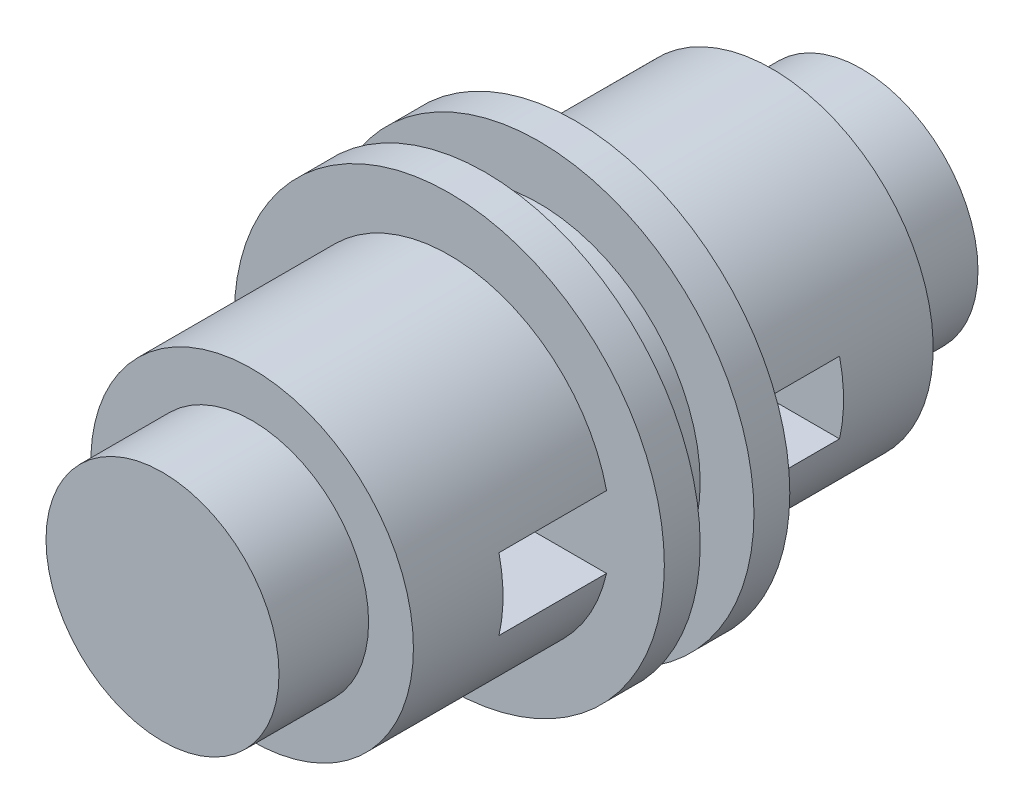
ISO-10303-21;
HEADER;
FILE_DESCRIPTION(('STEP AP214'),'2;1');
FILE_NAME('part.step','',(''),(''),'','','');
FILE_SCHEMA(('AUTOMOTIVE_DESIGN { 1 0 10303 214 1 1 1 1 }'));
ENDSEC;
DATA;
#1=APPLICATION_CONTEXT('core data for automotive mechanical design processes');
#2=APPLICATION_PROTOCOL_DEFINITION('international standard','automotive_design',2000,#1);
#3=PRODUCT_CONTEXT('',#1,'mechanical');
#4=PRODUCT('Part','Part','',(#3));
#5=PRODUCT_RELATED_PRODUCT_CATEGORY('part','',(#4));
#6=PRODUCT_DEFINITION_FORMATION('','',#4);
#7=PRODUCT_DEFINITION_CONTEXT('part definition',#1,'design');
#8=PRODUCT_DEFINITION('design','',#6,#7);
#9=PRODUCT_DEFINITION_SHAPE('','',#8);
#10=(LENGTH_UNIT() NAMED_UNIT(*) SI_UNIT(.MILLI.,.METRE.));
#11=(NAMED_UNIT(*) PLANE_ANGLE_UNIT() SI_UNIT($,.RADIAN.));
#12=(NAMED_UNIT(*) SI_UNIT($,.STERADIAN.) SOLID_ANGLE_UNIT());
#13=UNCERTAINTY_MEASURE_WITH_UNIT(LENGTH_MEASURE(1.E-05),#10,'distance_accuracy_value','');
#14=(GEOMETRIC_REPRESENTATION_CONTEXT(3) GLOBAL_UNCERTAINTY_ASSIGNED_CONTEXT((#13)) GLOBAL_UNIT_ASSIGNED_CONTEXT((#10,
#11,#12)) REPRESENTATION_CONTEXT('',''));
#15=CARTESIAN_POINT('',(0.,0.,0.));
#16=DIRECTION('',(0.,0.,1.));
#17=DIRECTION('',(1.,0.,0.));
#18=AXIS2_PLACEMENT_3D('',#15,#16,#17);
#19=CARTESIAN_POINT('',(0.,0.,3.));
#20=DIRECTION('',(0.,0.,-1.));
#21=DIRECTION('',(-1.,0.,0.));
#22=AXIS2_PLACEMENT_3D('',#19,#20,#21);
#23=CYLINDRICAL_SURFACE('',#22,4.5);
#24=CARTESIAN_POINT('',(0.,0.,0.));
#25=DIRECTION('',(0.,0.,1.));
#26=DIRECTION('',(1.,0.,0.));
#27=AXIS2_PLACEMENT_3D('',#24,#25,#26);
#28=CIRCLE('',#27,4.5);
#29=CARTESIAN_POINT('',(4.38748219369606,1.,0.));
#30=VERTEX_POINT('',#29);
#31=CARTESIAN_POINT('',(-4.38748219369606,1.,0.));
#32=VERTEX_POINT('',#31);
#33=EDGE_CURVE('E161',#30,#32,#28,.T.);
#34=ORIENTED_EDGE('',*,*,#33,.T.);
#35=DIRECTION('',(0.,0.,-1.));
#36=VECTOR('',#35,1.);
#37=CARTESIAN_POINT('',(-4.38748219369606,1.,3.));
#38=LINE('',#37,#36);
#39=CARTESIAN_POINT('',(-4.38748219369606,1.,3.));
#40=VERTEX_POINT('',#39);
#41=EDGE_CURVE('E195',#32,#40,#38,.F.);
#42=ORIENTED_EDGE('',*,*,#41,.T.);
#43=CARTESIAN_POINT('',(0.,0.,3.));
#44=DIRECTION('',(0.,0.,1.));
#45=DIRECTION('',(1.,0.,0.));
#46=AXIS2_PLACEMENT_3D('',#43,#44,#45);
#47=CIRCLE('',#46,4.5);
#48=CARTESIAN_POINT('',(-4.38748219369606,-1.,3.));
#49=VERTEX_POINT('',#48);
#50=EDGE_CURVE('E44',#40,#49,#47,.T.);
#51=ORIENTED_EDGE('',*,*,#50,.T.);
#52=DIRECTION('',(0.,0.,-1.));
#53=VECTOR('',#52,1.);
#54=CARTESIAN_POINT('',(-4.38748219369606,-1.,3.));
#55=LINE('',#54,#53);
#56=CARTESIAN_POINT('',(-4.38748219369606,-1.,0.));
#57=VERTEX_POINT('',#56);
#58=EDGE_CURVE('E178',#49,#57,#55,.T.);
#59=ORIENTED_EDGE('',*,*,#58,.T.);
#60=CARTESIAN_POINT('',(4.38748219369606,-1.,0.));
#61=VERTEX_POINT('',#60);
#62=EDGE_CURVE('E165',#57,#61,#28,.T.);
#63=ORIENTED_EDGE('',*,*,#62,.T.);
#64=DIRECTION('',(0.,0.,-1.));
#65=VECTOR('',#64,1.);
#66=CARTESIAN_POINT('',(4.38748219369606,-1.,3.));
#67=LINE('',#66,#65);
#68=CARTESIAN_POINT('',(4.38748219369606,-1.,3.));
#69=VERTEX_POINT('',#68);
#70=EDGE_CURVE('E176',#61,#69,#67,.F.);
#71=ORIENTED_EDGE('',*,*,#70,.T.);
#72=CARTESIAN_POINT('',(4.38748219369606,1.,3.));
#73=VERTEX_POINT('',#72);
#74=EDGE_CURVE('E11',#69,#73,#47,.T.);
#75=ORIENTED_EDGE('',*,*,#74,.T.);
#76=DIRECTION('',(0.,0.,-1.));
#77=VECTOR('',#76,1.);
#78=CARTESIAN_POINT('',(4.38748219369606,1.,3.));
#79=LINE('',#78,#77);
#80=EDGE_CURVE('E197',#73,#30,#79,.T.);
#81=ORIENTED_EDGE('',*,*,#80,.T.);
#82=EDGE_LOOP('',(#34,#42,#51,#59,#63,#71,#75,#81));
#83=FACE_BOUND('',#82,.T.);
#84=CARTESIAN_POINT('',(0.,0.,5.5));
#85=DIRECTION('',(0.,0.,1.));
#86=DIRECTION('',(1.,0.,0.));
#87=AXIS2_PLACEMENT_3D('',#84,#85,#86);
#88=CIRCLE('',#87,4.5);
#89=CARTESIAN_POINT('',(4.5,0.,5.5));
#90=VERTEX_POINT('',#89);
#91=EDGE_CURVE('E202',#90,#90,#88,.T.);
#92=ORIENTED_EDGE('',*,*,#91,.F.);
#93=EDGE_LOOP('',(#92));
#94=FACE_BOUND('',#93,.T.);
#95=ADVANCED_FACE('F41',(#83,#94),#23,.T.);
#96=CARTESIAN_POINT('',(0.,0.,-1.));
#97=DIRECTION('',(0.,0.,1.));
#98=DIRECTION('',(1.,0.,0.));
#99=AXIS2_PLACEMENT_3D('',#96,#97,#98);
#100=CYLINDRICAL_SURFACE('',#99,6.);
#101=CARTESIAN_POINT('',(0.,0.,-1.));
#102=DIRECTION('',(0.,0.,-1.));
#103=DIRECTION('',(-1.,0.,0.));
#104=AXIS2_PLACEMENT_3D('',#101,#102,#103);
#105=CIRCLE('',#104,6.);
#106=CARTESIAN_POINT('',(-6.,0.,-1.));
#107=VERTEX_POINT('',#106);
#108=EDGE_CURVE('E162',#107,#107,#105,.T.);
#109=ORIENTED_EDGE('',*,*,#108,.F.);
#110=EDGE_LOOP('',(#109));
#111=FACE_BOUND('',#110,.T.);
#112=CARTESIAN_POINT('',(0.,0.,0.));
#113=DIRECTION('',(0.,0.,-1.));
#114=DIRECTION('',(-1.,0.,0.));
#115=AXIS2_PLACEMENT_3D('',#112,#113,#114);
#116=CIRCLE('',#115,6.);
#117=CARTESIAN_POINT('',(-6.,0.,0.));
#118=VERTEX_POINT('',#117);
#119=EDGE_CURVE('E158',#118,#118,#116,.T.);
#120=ORIENTED_EDGE('',*,*,#119,.T.);
#121=EDGE_LOOP('',(#120));
#122=FACE_BOUND('',#121,.T.);
#123=ADVANCED_FACE('F230',(#111,#122),#100,.T.);
#124=CARTESIAN_POINT('',(0.,0.,-1.));
#125=DIRECTION('',(0.,0.,-1.));
#126=DIRECTION('',(-1.,0.,0.));
#127=AXIS2_PLACEMENT_3D('',#124,#125,#126);
#128=PLANE('',#127);
#129=CARTESIAN_POINT('',(0.,0.,-1.));
#130=DIRECTION('',(0.,0.,-1.));
#131=DIRECTION('',(-1.,0.,0.));
#132=AXIS2_PLACEMENT_3D('',#129,#130,#131);
#133=CIRCLE('',#132,4.5);
#134=CARTESIAN_POINT('',(-4.5,0.,-1.));
#135=VERTEX_POINT('',#134);
#136=EDGE_CURVE('E148',#135,#135,#133,.T.);
#137=ORIENTED_EDGE('',*,*,#136,.F.);
#138=EDGE_LOOP('',(#137));
#139=FACE_BOUND('',#138,.T.);
#140=ORIENTED_EDGE('',*,*,#108,.T.);
#141=EDGE_LOOP('',(#140));
#142=FACE_BOUND('',#141,.T.);
#143=ADVANCED_FACE('F235',(#139,#142),#128,.T.);
#144=CARTESIAN_POINT('',(0.,0.,0.));
#145=DIRECTION('',(0.,0.,-1.));
#146=DIRECTION('',(-1.,0.,0.));
#147=AXIS2_PLACEMENT_3D('',#144,#145,#146);
#148=PLANE('',#147);
#149=ORIENTED_EDGE('',*,*,#33,.F.);
#150=DIRECTION('',(-1.,0.,0.));
#151=VECTOR('',#150,1.);
#152=CARTESIAN_POINT('',(25.45,1.,0.));
#153=LINE('',#152,#151);
#154=EDGE_CURVE('E189',#30,#32,#153,.T.);
#155=ORIENTED_EDGE('',*,*,#154,.T.);
#156=EDGE_LOOP('',(#149,#155));
#157=FACE_BOUND('',#156,.T.);
#158=DIRECTION('',(-1.,0.,0.));
#159=VECTOR('',#158,1.);
#160=CARTESIAN_POINT('',(25.45,-1.,0.));
#161=LINE('',#160,#159);
#162=EDGE_CURVE('E60',#61,#57,#161,.T.);
#163=ORIENTED_EDGE('',*,*,#162,.F.);
#164=ORIENTED_EDGE('',*,*,#62,.F.);
#165=EDGE_LOOP('',(#163,#164));
#166=FACE_BOUND('',#165,.T.);
#167=ORIENTED_EDGE('',*,*,#119,.F.);
#168=EDGE_LOOP('',(#167));
#169=FACE_BOUND('',#168,.T.);
#170=ADVANCED_FACE('F180',(#157,#166,#169),#148,.F.);
#171=CARTESIAN_POINT('',(0.,0.,-2.5));
#172=DIRECTION('',(0.,0.,1.));
#173=DIRECTION('',(1.,0.,0.));
#174=AXIS2_PLACEMENT_3D('',#171,#172,#173);
#175=CYLINDRICAL_SURFACE('',#174,4.5);
#176=CARTESIAN_POINT('',(0.,0.,-2.5));
#177=DIRECTION('',(0.,0.,-1.));
#178=DIRECTION('',(-1.,0.,0.));
#179=AXIS2_PLACEMENT_3D('',#176,#177,#178);
#180=CIRCLE('',#179,4.5);
#181=CARTESIAN_POINT('',(-4.5,0.,-2.5));
#182=VERTEX_POINT('',#181);
#183=EDGE_CURVE('E152',#182,#182,#180,.T.);
#184=ORIENTED_EDGE('',*,*,#183,.F.);
#185=EDGE_LOOP('',(#184));
#186=FACE_BOUND('',#185,.T.);
#187=ORIENTED_EDGE('',*,*,#136,.T.);
#188=EDGE_LOOP('',(#187));
#189=FACE_BOUND('',#188,.T.);
#190=ADVANCED_FACE('F247',(#186,#189),#175,.T.);
#191=CARTESIAN_POINT('',(0.,0.,-3.5));
#192=DIRECTION('',(0.,0.,1.));
#193=DIRECTION('',(1.,0.,0.));
#194=AXIS2_PLACEMENT_3D('',#191,#192,#193);
#195=CYLINDRICAL_SURFACE('',#194,6.);
#196=CARTESIAN_POINT('',(0.,0.,-3.5));
#197=DIRECTION('',(0.,0.,-1.));
#198=DIRECTION('',(-1.,0.,0.));
#199=AXIS2_PLACEMENT_3D('',#196,#197,#198);
#200=CIRCLE('',#199,6.);
#201=CARTESIAN_POINT('',(-6.,0.,-3.5));
#202=VERTEX_POINT('',#201);
#203=EDGE_CURVE('E149',#202,#202,#200,.T.);
#204=ORIENTED_EDGE('',*,*,#203,.F.);
#205=EDGE_LOOP('',(#204));
#206=FACE_BOUND('',#205,.T.);
#207=CARTESIAN_POINT('',(0.,0.,-2.5));
#208=DIRECTION('',(0.,0.,-1.));
#209=DIRECTION('',(-1.,0.,0.));
#210=AXIS2_PLACEMENT_3D('',#207,#208,#209);
#211=CIRCLE('',#210,6.);
#212=CARTESIAN_POINT('',(-6.,0.,-2.5));
#213=VERTEX_POINT('',#212);
#214=EDGE_CURVE('E153',#213,#213,#211,.T.);
#215=ORIENTED_EDGE('',*,*,#214,.T.);
#216=EDGE_LOOP('',(#215));
#217=FACE_BOUND('',#216,.T.);
#218=ADVANCED_FACE('F252',(#206,#217),#195,.T.);
#219=CARTESIAN_POINT('',(0.,0.,-3.5));
#220=DIRECTION('',(0.,0.,-1.));
#221=DIRECTION('',(-1.,0.,0.));
#222=AXIS2_PLACEMENT_3D('',#219,#220,#221);
#223=PLANE('',#222);
#224=CARTESIAN_POINT('',(0.,0.,-3.5));
#225=DIRECTION('',(0.,0.,-1.));
#226=DIRECTION('',(-1.,0.,0.));
#227=AXIS2_PLACEMENT_3D('',#224,#225,#226);
#228=CIRCLE('',#227,4.5);
#229=CARTESIAN_POINT('',(-4.38748219369606,1.,-3.5));
#230=VERTEX_POINT('',#229);
#231=CARTESIAN_POINT('',(4.38748219369606,1.,-3.5));
#232=VERTEX_POINT('',#231);
#233=EDGE_CURVE('E138',#230,#232,#228,.T.);
#234=ORIENTED_EDGE('',*,*,#233,.F.);
#235=DIRECTION('',(-1.,0.,0.));
#236=VECTOR('',#235,1.);
#237=CARTESIAN_POINT('',(25.45,1.,-3.5));
#238=LINE('',#237,#236);
#239=EDGE_CURVE('E428',#232,#230,#238,.T.);
#240=ORIENTED_EDGE('',*,*,#239,.F.);
#241=EDGE_LOOP('',(#234,#240));
#242=FACE_BOUND('',#241,.T.);
#243=ORIENTED_EDGE('',*,*,#203,.T.);
#244=EDGE_LOOP('',(#243));
#245=FACE_BOUND('',#244,.T.);
#246=CARTESIAN_POINT('',(4.38748219369606,-1.,-3.5));
#247=VERTEX_POINT('',#246);
#248=CARTESIAN_POINT('',(-4.38748219369606,-1.,-3.5));
#249=VERTEX_POINT('',#248);
#250=EDGE_CURVE('E142',#247,#249,#228,.T.);
#251=ORIENTED_EDGE('',*,*,#250,.F.);
#252=DIRECTION('',(-1.,0.,0.));
#253=VECTOR('',#252,1.);
#254=CARTESIAN_POINT('',(25.45,-1.,-3.5));
#255=LINE('',#254,#253);
#256=EDGE_CURVE('E109',#247,#249,#255,.T.);
#257=ORIENTED_EDGE('',*,*,#256,.T.);
#258=EDGE_LOOP('',(#251,#257));
#259=FACE_BOUND('',#258,.T.);
#260=ADVANCED_FACE('F256',(#242,#245,#259),#223,.T.);
#261=CARTESIAN_POINT('',(0.,0.,-2.5));
#262=DIRECTION('',(0.,0.,-1.));
#263=DIRECTION('',(-1.,0.,0.));
#264=AXIS2_PLACEMENT_3D('',#261,#262,#263);
#265=PLANE('',#264);
#266=ORIENTED_EDGE('',*,*,#183,.T.);
#267=EDGE_LOOP('',(#266));
#268=FACE_BOUND('',#267,.T.);
#269=ORIENTED_EDGE('',*,*,#214,.F.);
#270=EDGE_LOOP('',(#269));
#271=FACE_BOUND('',#270,.T.);
#272=ADVANCED_FACE('F258',(#268,#271),#265,.F.);
#273=CARTESIAN_POINT('',(0.,0.,-6.5));
#274=DIRECTION('',(0.,0.,1.));
#275=DIRECTION('',(1.,0.,0.));
#276=AXIS2_PLACEMENT_3D('',#273,#274,#275);
#277=CYLINDRICAL_SURFACE('',#276,4.5);
#278=CARTESIAN_POINT('',(0.,0.,-6.5));
#279=DIRECTION('',(0.,0.,-1.));
#280=DIRECTION('',(-1.,0.,0.));
#281=AXIS2_PLACEMENT_3D('',#278,#279,#280);
#282=CIRCLE('',#281,4.5);
#283=CARTESIAN_POINT('',(-4.38748219369606,-1.,-6.5));
#284=VERTEX_POINT('',#283);
#285=CARTESIAN_POINT('',(-4.38748219369606,1.,-6.5));
#286=VERTEX_POINT('',#285);
#287=EDGE_CURVE('E121',#284,#286,#282,.T.);
#288=ORIENTED_EDGE('',*,*,#287,.T.);
#289=DIRECTION('',(0.,0.,1.));
#290=VECTOR('',#289,1.);
#291=CARTESIAN_POINT('',(-4.38748219369606,1.,-6.5));
#292=LINE('',#291,#290);
#293=EDGE_CURVE('E130',#286,#230,#292,.T.);
#294=ORIENTED_EDGE('',*,*,#293,.T.);
#295=ORIENTED_EDGE('',*,*,#233,.T.);
#296=DIRECTION('',(0.,0.,1.));
#297=VECTOR('',#296,1.);
#298=CARTESIAN_POINT('',(4.38748219369606,1.,-6.5));
#299=LINE('',#298,#297);
#300=CARTESIAN_POINT('',(4.38748219369606,1.,-6.5));
#301=VERTEX_POINT('',#300);
#302=EDGE_CURVE('E128',#232,#301,#299,.F.);
#303=ORIENTED_EDGE('',*,*,#302,.T.);
#304=CARTESIAN_POINT('',(4.38748219369606,-1.,-6.5));
#305=VERTEX_POINT('',#304);
#306=EDGE_CURVE('E114',#301,#305,#282,.T.);
#307=ORIENTED_EDGE('',*,*,#306,.T.);
#308=DIRECTION('',(0.,0.,1.));
#309=VECTOR('',#308,1.);
#310=CARTESIAN_POINT('',(4.38748219369606,-1.,-6.5));
#311=LINE('',#310,#309);
#312=EDGE_CURVE('E103',#305,#247,#311,.T.);
#313=ORIENTED_EDGE('',*,*,#312,.T.);
#314=ORIENTED_EDGE('',*,*,#250,.T.);
#315=DIRECTION('',(0.,0.,1.));
#316=VECTOR('',#315,1.);
#317=CARTESIAN_POINT('',(-4.38748219369606,-1.,-6.5));
#318=LINE('',#317,#316);
#319=EDGE_CURVE('E115',#249,#284,#318,.F.);
#320=ORIENTED_EDGE('',*,*,#319,.T.);
#321=EDGE_LOOP('',(#288,#294,#295,#303,#307,#313,#314,#320));
#322=FACE_BOUND('',#321,.T.);
#323=CARTESIAN_POINT('',(0.,0.,-9.));
#324=DIRECTION('',(0.,0.,-1.));
#325=DIRECTION('',(-1.,0.,0.));
#326=AXIS2_PLACEMENT_3D('',#323,#324,#325);
#327=CIRCLE('',#326,4.5);
#328=CARTESIAN_POINT('',(-4.5,0.,-9.));
#329=VERTEX_POINT('',#328);
#330=EDGE_CURVE('E199',#329,#329,#327,.T.);
#331=ORIENTED_EDGE('',*,*,#330,.F.);
#332=EDGE_LOOP('',(#331));
#333=FACE_BOUND('',#332,.T.);
#334=ADVANCED_FACE('F125',(#322,#333),#277,.T.);
#335=CARTESIAN_POINT('',(0.,0.,8.));
#336=DIRECTION('',(0.,0.,1.));
#337=DIRECTION('',(1.,0.,0.));
#338=AXIS2_PLACEMENT_3D('',#335,#336,#337);
#339=PLANE('',#338);
#340=CARTESIAN_POINT('',(0.,0.,8.));
#341=DIRECTION('',(0.,0.,1.));
#342=DIRECTION('',(1.,0.,0.));
#343=AXIS2_PLACEMENT_3D('',#340,#341,#342);
#344=CIRCLE('',#343,3.25);
#345=CARTESIAN_POINT('',(3.25,0.,8.));
#346=VERTEX_POINT('',#345);
#347=EDGE_CURVE('E145',#346,#346,#344,.T.);
#348=ORIENTED_EDGE('',*,*,#347,.T.);
#349=EDGE_LOOP('',(#348));
#350=FACE_BOUND('',#349,.T.);
#351=ADVANCED_FACE('F267',(#350),#339,.T.);
#352=CARTESIAN_POINT('',(0.,0.,8.));
#353=DIRECTION('',(0.,0.,-1.));
#354=DIRECTION('',(-1.,0.,0.));
#355=AXIS2_PLACEMENT_3D('',#352,#353,#354);
#356=CYLINDRICAL_SURFACE('',#355,3.25);
#357=ORIENTED_EDGE('',*,*,#347,.F.);
#358=EDGE_LOOP('',(#357));
#359=FACE_BOUND('',#358,.T.);
#360=CARTESIAN_POINT('',(0.,0.,5.5));
#361=DIRECTION('',(0.,0.,1.));
#362=DIRECTION('',(1.,0.,0.));
#363=AXIS2_PLACEMENT_3D('',#360,#361,#362);
#364=CIRCLE('',#363,3.25);
#365=CARTESIAN_POINT('',(3.25,0.,5.5));
#366=VERTEX_POINT('',#365);
#367=EDGE_CURVE('E134',#366,#366,#364,.T.);
#368=ORIENTED_EDGE('',*,*,#367,.T.);
#369=EDGE_LOOP('',(#368));
#370=FACE_BOUND('',#369,.T.);
#371=ADVANCED_FACE('F270',(#359,#370),#356,.T.);
#372=CARTESIAN_POINT('',(0.,0.,5.5));
#373=DIRECTION('',(0.,0.,1.));
#374=DIRECTION('',(1.,0.,0.));
#375=AXIS2_PLACEMENT_3D('',#372,#373,#374);
#376=PLANE('',#375);
#377=ORIENTED_EDGE('',*,*,#367,.F.);
#378=EDGE_LOOP('',(#377));
#379=FACE_BOUND('',#378,.T.);
#380=ORIENTED_EDGE('',*,*,#91,.T.);
#381=EDGE_LOOP('',(#380));
#382=FACE_BOUND('',#381,.T.);
#383=ADVANCED_FACE('F226',(#379,#382),#376,.T.);
#384=CARTESIAN_POINT('',(0.,0.,-11.5));
#385=DIRECTION('',(0.,0.,-1.));
#386=DIRECTION('',(1.,0.,0.));
#387=AXIS2_PLACEMENT_3D('',#384,#385,#386);
#388=PLANE('',#387);
#389=CARTESIAN_POINT('',(0.,0.,-11.5));
#390=DIRECTION('',(0.,0.,1.));
#391=DIRECTION('',(1.,0.,0.));
#392=AXIS2_PLACEMENT_3D('',#389,#390,#391);
#393=CIRCLE('',#392,3.25);
#394=CARTESIAN_POINT('',(3.25,0.,-11.5));
#395=VERTEX_POINT('',#394);
#396=EDGE_CURVE('E206',#395,#395,#393,.T.);
#397=ORIENTED_EDGE('',*,*,#396,.F.);
#398=EDGE_LOOP('',(#397));
#399=FACE_BOUND('',#398,.T.);
#400=ADVANCED_FACE('F216',(#399),#388,.T.);
#401=CARTESIAN_POINT('',(0.,0.,-11.5));
#402=DIRECTION('',(0.,0.,1.));
#403=DIRECTION('',(1.,0.,0.));
#404=AXIS2_PLACEMENT_3D('',#401,#402,#403);
#405=CYLINDRICAL_SURFACE('',#404,3.25);
#406=ORIENTED_EDGE('',*,*,#396,.T.);
#407=EDGE_LOOP('',(#406));
#408=FACE_BOUND('',#407,.T.);
#409=CARTESIAN_POINT('',(0.,0.,-9.));
#410=DIRECTION('',(0.,0.,1.));
#411=DIRECTION('',(1.,0.,0.));
#412=AXIS2_PLACEMENT_3D('',#409,#410,#411);
#413=CIRCLE('',#412,3.25);
#414=CARTESIAN_POINT('',(3.25,0.,-9.));
#415=VERTEX_POINT('',#414);
#416=EDGE_CURVE('E205',#415,#415,#413,.T.);
#417=ORIENTED_EDGE('',*,*,#416,.F.);
#418=EDGE_LOOP('',(#417));
#419=FACE_BOUND('',#418,.T.);
#420=ADVANCED_FACE('F214',(#408,#419),#405,.T.);
#421=CARTESIAN_POINT('',(0.,0.,-9.));
#422=DIRECTION('',(0.,0.,-1.));
#423=DIRECTION('',(1.,0.,0.));
#424=AXIS2_PLACEMENT_3D('',#421,#422,#423);
#425=PLANE('',#424);
#426=ORIENTED_EDGE('',*,*,#416,.T.);
#427=EDGE_LOOP('',(#426));
#428=FACE_BOUND('',#427,.T.);
#429=ORIENTED_EDGE('',*,*,#330,.T.);
#430=EDGE_LOOP('',(#429));
#431=FACE_BOUND('',#430,.T.);
#432=ADVANCED_FACE('F211',(#428,#431),#425,.T.);
#433=CARTESIAN_POINT('',(25.45,-1.,-6.5));
#434=DIRECTION('',(0.,0.,-1.));
#435=DIRECTION('',(-1.,0.,0.));
#436=AXIS2_PLACEMENT_3D('',#433,#434,#435);
#437=PLANE('',#436);
#438=DIRECTION('',(-1.,0.,0.));
#439=VECTOR('',#438,1.);
#440=CARTESIAN_POINT('',(25.45,1.,-6.5));
#441=LINE('',#440,#439);
#442=EDGE_CURVE('E193',#301,#286,#441,.T.);
#443=ORIENTED_EDGE('',*,*,#442,.T.);
#444=ORIENTED_EDGE('',*,*,#287,.F.);
#445=DIRECTION('',(-1.,0.,0.));
#446=VECTOR('',#445,1.);
#447=CARTESIAN_POINT('',(25.45,-1.,-6.5));
#448=LINE('',#447,#446);
#449=EDGE_CURVE('E106',#305,#284,#448,.T.);
#450=ORIENTED_EDGE('',*,*,#449,.F.);
#451=ORIENTED_EDGE('',*,*,#306,.F.);
#452=EDGE_LOOP('',(#443,#444,#450,#451));
#453=FACE_BOUND('',#452,.T.);
#454=ADVANCED_FACE('F119',(#453),#437,.F.);
#455=CARTESIAN_POINT('',(25.45,1.,-6.5));
#456=DIRECTION('',(0.,1.,0.));
#457=DIRECTION('',(0.,0.,1.));
#458=AXIS2_PLACEMENT_3D('',#455,#456,#457);
#459=PLANE('',#458);
#460=ORIENTED_EDGE('',*,*,#442,.F.);
#461=ORIENTED_EDGE('',*,*,#302,.F.);
#462=ORIENTED_EDGE('',*,*,#239,.T.);
#463=ORIENTED_EDGE('',*,*,#293,.F.);
#464=EDGE_LOOP('',(#460,#461,#462,#463));
#465=FACE_BOUND('',#464,.T.);
#466=ADVANCED_FACE('F370',(#465),#459,.F.);
#467=CARTESIAN_POINT('',(25.45,-1.,-6.5));
#468=DIRECTION('',(0.,-1.,0.));
#469=DIRECTION('',(0.,0.,-1.));
#470=AXIS2_PLACEMENT_3D('',#467,#468,#469);
#471=PLANE('',#470);
#472=ORIENTED_EDGE('',*,*,#449,.T.);
#473=ORIENTED_EDGE('',*,*,#319,.F.);
#474=ORIENTED_EDGE('',*,*,#256,.F.);
#475=ORIENTED_EDGE('',*,*,#312,.F.);
#476=EDGE_LOOP('',(#472,#473,#474,#475));
#477=FACE_BOUND('',#476,.T.);
#478=ADVANCED_FACE('F105',(#477),#471,.F.);
#479=CARTESIAN_POINT('',(25.45,-1.,3.));
#480=DIRECTION('',(0.,0.,1.));
#481=DIRECTION('',(1.,0.,0.));
#482=AXIS2_PLACEMENT_3D('',#479,#480,#481);
#483=PLANE('',#482);
#484=DIRECTION('',(-1.,0.,0.));
#485=VECTOR('',#484,1.);
#486=CARTESIAN_POINT('',(25.45,1.,3.));
#487=LINE('',#486,#485);
#488=EDGE_CURVE('E183',#73,#40,#487,.T.);
#489=ORIENTED_EDGE('',*,*,#488,.F.);
#490=ORIENTED_EDGE('',*,*,#74,.F.);
#491=DIRECTION('',(-1.,0.,0.));
#492=VECTOR('',#491,1.);
#493=CARTESIAN_POINT('',(25.45,-1.,3.));
#494=LINE('',#493,#492);
#495=EDGE_CURVE('E55',#69,#49,#494,.T.);
#496=ORIENTED_EDGE('',*,*,#495,.T.);
#497=ORIENTED_EDGE('',*,*,#50,.F.);
#498=EDGE_LOOP('',(#489,#490,#496,#497));
#499=FACE_BOUND('',#498,.T.);
#500=ADVANCED_FACE('F384',(#499),#483,.F.);
#501=CARTESIAN_POINT('',(25.45,1.,0.));
#502=DIRECTION('',(0.,1.,0.));
#503=DIRECTION('',(0.,0.,1.));
#504=AXIS2_PLACEMENT_3D('',#501,#502,#503);
#505=PLANE('',#504);
#506=ORIENTED_EDGE('',*,*,#488,.T.);
#507=ORIENTED_EDGE('',*,*,#41,.F.);
#508=ORIENTED_EDGE('',*,*,#154,.F.);
#509=ORIENTED_EDGE('',*,*,#80,.F.);
#510=EDGE_LOOP('',(#506,#507,#508,#509));
#511=FACE_BOUND('',#510,.T.);
#512=ADVANCED_FACE('F391',(#511),#505,.F.);
#513=CARTESIAN_POINT('',(25.45,-1.,0.));
#514=DIRECTION('',(0.,-1.,0.));
#515=DIRECTION('',(0.,0.,-1.));
#516=AXIS2_PLACEMENT_3D('',#513,#514,#515);
#517=PLANE('',#516);
#518=ORIENTED_EDGE('',*,*,#495,.F.);
#519=ORIENTED_EDGE('',*,*,#70,.F.);
#520=ORIENTED_EDGE('',*,*,#162,.T.);
#521=ORIENTED_EDGE('',*,*,#58,.F.);
#522=EDGE_LOOP('',(#518,#519,#520,#521));
#523=FACE_BOUND('',#522,.T.);
#524=ADVANCED_FACE('F399',(#523),#517,.F.);
#525=CLOSED_SHELL('',(#95,#123,#143,#170,#190,#218,#260,#272,#334,#351,#371,#383,#400,#420,#432,
#454,#466,#478,#500,#512,#524));
#526=MANIFOLD_SOLID_BREP('B2',#525);
#527=ADVANCED_BREP_SHAPE_REPRESENTATION('',(#18,#526),#14);
#528=SHAPE_DEFINITION_REPRESENTATION(#9,#527);
ENDSEC;
END-ISO-10303-21;
